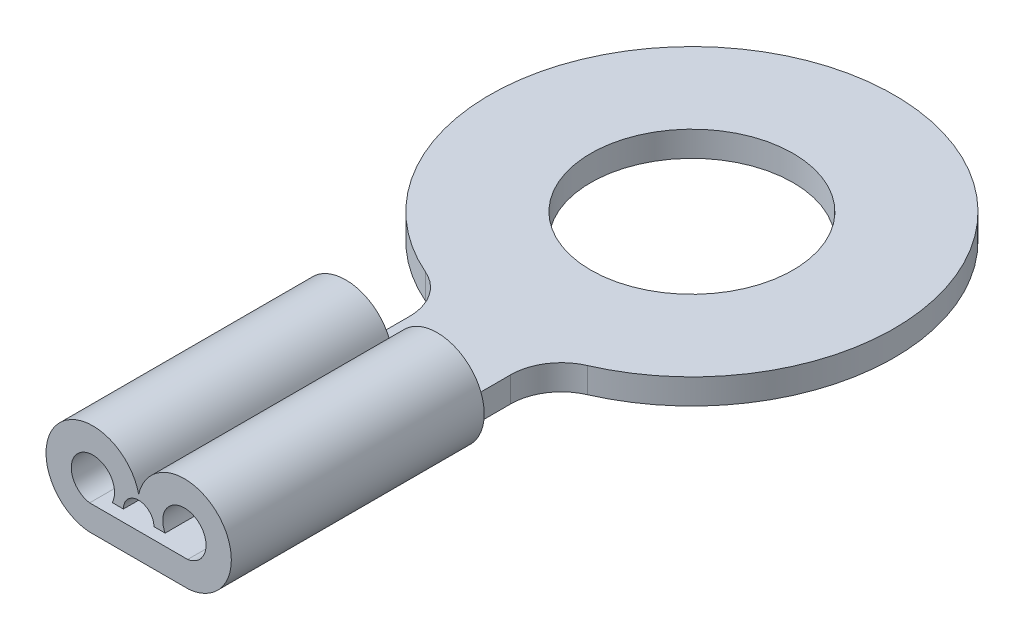
ISO-10303-21;
HEADER;
FILE_DESCRIPTION(('STEP AP214'),'2;1');
FILE_NAME('part.step','',(''),(''),'','','');
FILE_SCHEMA(('AUTOMOTIVE_DESIGN { 1 0 10303 214 1 1 1 1 }'));
ENDSEC;
DATA;
#1=APPLICATION_CONTEXT('core data for automotive mechanical design processes');
#2=APPLICATION_PROTOCOL_DEFINITION('international standard','automotive_design',2000,#1);
#3=PRODUCT_CONTEXT('',#1,'mechanical');
#4=PRODUCT('Part','Part','',(#3));
#5=PRODUCT_RELATED_PRODUCT_CATEGORY('part','',(#4));
#6=PRODUCT_DEFINITION_FORMATION('','',#4);
#7=PRODUCT_DEFINITION_CONTEXT('part definition',#1,'design');
#8=PRODUCT_DEFINITION('design','',#6,#7);
#9=PRODUCT_DEFINITION_SHAPE('','',#8);
#10=(LENGTH_UNIT() NAMED_UNIT(*) SI_UNIT(.MILLI.,.METRE.));
#11=(NAMED_UNIT(*) PLANE_ANGLE_UNIT() SI_UNIT($,.RADIAN.));
#12=(NAMED_UNIT(*) SI_UNIT($,.STERADIAN.) SOLID_ANGLE_UNIT());
#13=UNCERTAINTY_MEASURE_WITH_UNIT(LENGTH_MEASURE(1.E-05),#10,'distance_accuracy_value','');
#14=(GEOMETRIC_REPRESENTATION_CONTEXT(3) GLOBAL_UNCERTAINTY_ASSIGNED_CONTEXT((#13)) GLOBAL_UNIT_ASSIGNED_CONTEXT((#10,
#11,#12)) REPRESENTATION_CONTEXT('',''));
#15=CARTESIAN_POINT('',(0.,0.,0.));
#16=DIRECTION('',(0.,0.,1.));
#17=DIRECTION('',(1.,0.,0.));
#18=AXIS2_PLACEMENT_3D('',#15,#16,#17);
#19=CARTESIAN_POINT('',(-2.,0.5,4.58257569495584));
#20=DIRECTION('',(0.,-1.,0.));
#21=DIRECTION('',(0.,0.,-1.));
#22=AXIS2_PLACEMENT_3D('',#19,#20,#21);
#23=PLANE('',#22);
#24=DIRECTION('',(0.,0.,1.));
#25=VECTOR('',#24,1.);
#26=CARTESIAN_POINT('',(-1.,0.5,4.58257569495584));
#27=LINE('',#26,#25);
#28=CARTESIAN_POINT('',(-1.,0.5,4.58257569495584));
#29=VERTEX_POINT('',#28);
#30=CARTESIAN_POINT('',(-1.,0.5,5.93878443953007));
#31=VERTEX_POINT('',#30);
#32=EDGE_CURVE('E212',#29,#31,#27,.T.);
#33=ORIENTED_EDGE('',*,*,#32,.T.);
#34=DIRECTION('',(1.,0.,0.));
#35=VECTOR('',#34,1.);
#36=CARTESIAN_POINT('',(-2.,0.5,5.93878443953007));
#37=LINE('',#36,#35);
#38=CARTESIAN_POINT('',(-0.969184807981121,0.5,5.93878443953007));
#39=VERTEX_POINT('',#38);
#40=EDGE_CURVE('E196',#31,#39,#37,.T.);
#41=ORIENTED_EDGE('',*,*,#40,.T.);
#42=DIRECTION('',(0.,0.,1.));
#43=VECTOR('',#42,1.);
#44=CARTESIAN_POINT('',(-0.969184807981121,0.5,5.93878443953007));
#45=LINE('',#44,#43);
#46=CARTESIAN_POINT('',(-0.969184807981121,0.5,10.9387844395301));
#47=VERTEX_POINT('',#46);
#48=EDGE_CURVE('E200',#47,#39,#45,.F.);
#49=ORIENTED_EDGE('',*,*,#48,.F.);
#50=DIRECTION('',(1.,0.,0.));
#51=VECTOR('',#50,1.);
#52=CARTESIAN_POINT('',(-1.,0.5,10.9387844395301));
#53=LINE('',#52,#51);
#54=CARTESIAN_POINT('',(0.969184807981121,0.5,10.9387844395301));
#55=VERTEX_POINT('',#54);
#56=EDGE_CURVE('E52',#47,#55,#53,.T.);
#57=ORIENTED_EDGE('',*,*,#56,.T.);
#58=DIRECTION('',(0.,0.,1.));
#59=VECTOR('',#58,1.);
#60=CARTESIAN_POINT('',(0.969184807981121,0.5,5.93878443953007));
#61=LINE('',#60,#59);
#62=CARTESIAN_POINT('',(0.969184807981121,0.5,5.93878443953007));
#63=VERTEX_POINT('',#62);
#64=EDGE_CURVE('E47',#63,#55,#61,.T.);
#65=ORIENTED_EDGE('',*,*,#64,.F.);
#66=CARTESIAN_POINT('',(1.,0.5,5.93878443953007));
#67=VERTEX_POINT('',#66);
#68=EDGE_CURVE('E138',#63,#67,#37,.T.);
#69=ORIENTED_EDGE('',*,*,#68,.T.);
#70=DIRECTION('',(0.,0.,-1.));
#71=VECTOR('',#70,1.);
#72=CARTESIAN_POINT('',(1.,0.5,4.58257569495584));
#73=LINE('',#72,#71);
#74=CARTESIAN_POINT('',(1.,0.5,4.58257569495584));
#75=VERTEX_POINT('',#74);
#76=EDGE_CURVE('E217',#67,#75,#73,.T.);
#77=ORIENTED_EDGE('',*,*,#76,.T.);
#78=CARTESIAN_POINT('',(2.,0.5,4.58257569495584));
#79=DIRECTION('',(0.,-1.,0.));
#80=DIRECTION('',(0.,0.,1.));
#81=AXIS2_PLACEMENT_3D('',#78,#79,#80);
#82=CIRCLE('',#81,1.);
#83=CARTESIAN_POINT('',(1.6,0.5,3.66606055596467));
#84=VERTEX_POINT('',#83);
#85=EDGE_CURVE('E219',#75,#84,#82,.T.);
#86=ORIENTED_EDGE('',*,*,#85,.T.);
#87=CARTESIAN_POINT('',(0.,0.5,0.));
#88=DIRECTION('',(0.,1.,0.));
#89=DIRECTION('',(0.,0.,1.));
#90=AXIS2_PLACEMENT_3D('',#87,#88,#89);
#91=CIRCLE('',#90,4.);
#92=CARTESIAN_POINT('',(-1.6,0.5,3.66606055596467));
#93=VERTEX_POINT('',#92);
#94=EDGE_CURVE('E221',#84,#93,#91,.T.);
#95=ORIENTED_EDGE('',*,*,#94,.T.);
#96=CARTESIAN_POINT('',(-2.,0.5,4.58257569495584));
#97=DIRECTION('',(0.,-1.,0.));
#98=DIRECTION('',(0.,0.,-1.));
#99=AXIS2_PLACEMENT_3D('',#96,#97,#98);
#100=CIRCLE('',#99,1.);
#101=EDGE_CURVE('E209',#93,#29,#100,.T.);
#102=ORIENTED_EDGE('',*,*,#101,.T.);
#103=EDGE_LOOP('',(#33,#41,#49,#57,#65,#69,#77,#86,#95,#102));
#104=FACE_BOUND('',#103,.T.);
#105=CARTESIAN_POINT('',(0.,0.5,0.));
#106=DIRECTION('',(0.,1.,0.));
#107=DIRECTION('',(0.,0.,1.));
#108=AXIS2_PLACEMENT_3D('',#105,#106,#107);
#109=CIRCLE('',#108,2.);
#110=CARTESIAN_POINT('',(0.,0.5,2.));
#111=VERTEX_POINT('',#110);
#112=EDGE_CURVE('E203',#111,#111,#109,.T.);
#113=ORIENTED_EDGE('',*,*,#112,.F.);
#114=EDGE_LOOP('',(#113));
#115=FACE_BOUND('',#114,.T.);
#116=ADVANCED_FACE('F32',(#104,#115),#23,.F.);
#117=CARTESIAN_POINT('',(-2.,0.,4.58257569495584));
#118=DIRECTION('',(0.,-1.,0.));
#119=DIRECTION('',(0.,0.,-1.));
#120=AXIS2_PLACEMENT_3D('',#117,#118,#119);
#121=PLANE('',#120);
#122=DIRECTION('',(0.,0.,-1.));
#123=VECTOR('',#122,1.);
#124=CARTESIAN_POINT('',(1.,0.,4.58257569495584));
#125=LINE('',#124,#123);
#126=CARTESIAN_POINT('',(1.,0.,5.93878443953007));
#127=VERTEX_POINT('',#126);
#128=CARTESIAN_POINT('',(1.,0.,4.58257569495584));
#129=VERTEX_POINT('',#128);
#130=EDGE_CURVE('E232',#127,#129,#125,.T.);
#131=ORIENTED_EDGE('',*,*,#130,.F.);
#132=CARTESIAN_POINT('',(1.,0.,10.9387844395301));
#133=VERTEX_POINT('',#132);
#134=EDGE_CURVE('E233',#133,#127,#125,.T.);
#135=ORIENTED_EDGE('',*,*,#134,.F.);
#136=DIRECTION('',(1.,0.,0.));
#137=VECTOR('',#136,1.);
#138=CARTESIAN_POINT('',(-1.,0.,10.9387844395301));
#139=LINE('',#138,#137);
#140=CARTESIAN_POINT('',(-1.,0.,10.9387844395301));
#141=VERTEX_POINT('',#140);
#142=EDGE_CURVE('E229',#141,#133,#139,.T.);
#143=ORIENTED_EDGE('',*,*,#142,.F.);
#144=DIRECTION('',(0.,0.,1.));
#145=VECTOR('',#144,1.);
#146=CARTESIAN_POINT('',(-1.,0.,5.93878443953007));
#147=LINE('',#146,#145);
#148=CARTESIAN_POINT('',(-1.,0.,5.93878443953007));
#149=VERTEX_POINT('',#148);
#150=EDGE_CURVE('E186',#149,#141,#147,.T.);
#151=ORIENTED_EDGE('',*,*,#150,.F.);
#152=DIRECTION('',(0.,0.,1.));
#153=VECTOR('',#152,1.);
#154=CARTESIAN_POINT('',(-1.,0.,4.58257569495584));
#155=LINE('',#154,#153);
#156=CARTESIAN_POINT('',(-1.,0.,4.58257569495584));
#157=VERTEX_POINT('',#156);
#158=EDGE_CURVE('E226',#157,#149,#155,.T.);
#159=ORIENTED_EDGE('',*,*,#158,.F.);
#160=CARTESIAN_POINT('',(-2.,0.,4.58257569495584));
#161=DIRECTION('',(0.,-1.,0.));
#162=DIRECTION('',(0.,0.,-1.));
#163=AXIS2_PLACEMENT_3D('',#160,#161,#162);
#164=CIRCLE('',#163,1.);
#165=CARTESIAN_POINT('',(-1.6,0.,3.66606055596467));
#166=VERTEX_POINT('',#165);
#167=EDGE_CURVE('E206',#166,#157,#164,.T.);
#168=ORIENTED_EDGE('',*,*,#167,.F.);
#169=CARTESIAN_POINT('',(0.,0.,0.));
#170=DIRECTION('',(0.,1.,0.));
#171=DIRECTION('',(0.,0.,1.));
#172=AXIS2_PLACEMENT_3D('',#169,#170,#171);
#173=CIRCLE('',#172,4.);
#174=CARTESIAN_POINT('',(1.6,0.,3.66606055596467));
#175=VERTEX_POINT('',#174);
#176=EDGE_CURVE('E213',#175,#166,#173,.T.);
#177=ORIENTED_EDGE('',*,*,#176,.F.);
#178=CARTESIAN_POINT('',(2.,0.,4.58257569495584));
#179=DIRECTION('',(0.,-1.,0.));
#180=DIRECTION('',(0.,0.,1.));
#181=AXIS2_PLACEMENT_3D('',#178,#179,#180);
#182=CIRCLE('',#181,1.);
#183=EDGE_CURVE('E236',#129,#175,#182,.T.);
#184=ORIENTED_EDGE('',*,*,#183,.F.);
#185=EDGE_LOOP('',(#131,#135,#143,#151,#159,#168,#177,#184));
#186=FACE_BOUND('',#185,.T.);
#187=CARTESIAN_POINT('',(0.,0.,0.));
#188=DIRECTION('',(0.,1.,0.));
#189=DIRECTION('',(0.,0.,1.));
#190=AXIS2_PLACEMENT_3D('',#187,#188,#189);
#191=CIRCLE('',#190,2.);
#192=CARTESIAN_POINT('',(0.,0.,2.));
#193=VERTEX_POINT('',#192);
#194=EDGE_CURVE('E202',#193,#193,#191,.T.);
#195=ORIENTED_EDGE('',*,*,#194,.T.);
#196=EDGE_LOOP('',(#195));
#197=FACE_BOUND('',#196,.T.);
#198=ADVANCED_FACE('F257',(#186,#197),#121,.T.);
#199=CARTESIAN_POINT('',(-2.,0.5,4.58257569495584));
#200=DIRECTION('',(0.,-1.,0.));
#201=DIRECTION('',(0.,0.,-1.));
#202=AXIS2_PLACEMENT_3D('',#199,#200,#201);
#203=CYLINDRICAL_SURFACE('',#202,1.);
#204=ORIENTED_EDGE('',*,*,#167,.T.);
#205=DIRECTION('',(0.,-1.,0.));
#206=VECTOR('',#205,1.);
#207=CARTESIAN_POINT('',(-1.,0.5,4.58257569495584));
#208=LINE('',#207,#206);
#209=EDGE_CURVE('E40',#29,#157,#208,.T.);
#210=ORIENTED_EDGE('',*,*,#209,.F.);
#211=ORIENTED_EDGE('',*,*,#101,.F.);
#212=DIRECTION('',(0.,-1.,0.));
#213=VECTOR('',#212,1.);
#214=CARTESIAN_POINT('',(-1.6,0.5,3.66606055596467));
#215=LINE('',#214,#213);
#216=EDGE_CURVE('E223',#93,#166,#215,.T.);
#217=ORIENTED_EDGE('',*,*,#216,.T.);
#218=EDGE_LOOP('',(#204,#210,#211,#217));
#219=FACE_BOUND('',#218,.T.);
#220=ADVANCED_FACE('F34',(#219),#203,.F.);
#221=CARTESIAN_POINT('',(-1.,0.5,4.58257569495584));
#222=DIRECTION('',(1.,0.,0.));
#223=DIRECTION('',(0.,0.,-1.));
#224=AXIS2_PLACEMENT_3D('',#221,#222,#223);
#225=PLANE('',#224);
#226=ORIENTED_EDGE('',*,*,#158,.T.);
#227=DIRECTION('',(0.,1.,0.));
#228=VECTOR('',#227,1.);
#229=CARTESIAN_POINT('',(-1.,0.5,5.93878443953007));
#230=LINE('',#229,#228);
#231=EDGE_CURVE('E195',#149,#31,#230,.T.);
#232=ORIENTED_EDGE('',*,*,#231,.T.);
#233=ORIENTED_EDGE('',*,*,#32,.F.);
#234=ORIENTED_EDGE('',*,*,#209,.T.);
#235=EDGE_LOOP('',(#226,#232,#233,#234));
#236=FACE_BOUND('',#235,.T.);
#237=ADVANCED_FACE('F249',(#236),#225,.F.);
#238=CARTESIAN_POINT('',(-1.,0.5,10.9387844395301));
#239=DIRECTION('',(0.,0.,-1.));
#240=DIRECTION('',(-1.,0.,0.));
#241=AXIS2_PLACEMENT_3D('',#238,#239,#240);
#242=PLANE('',#241);
#243=ORIENTED_EDGE('',*,*,#56,.F.);
#244=CARTESIAN_POINT('',(-0.90429780550037,0.922932306539,10.9387844395301));
#245=DIRECTION('',(0.,0.,1.));
#246=DIRECTION('',(-1.,0.,0.));
#247=AXIS2_PLACEMENT_3D('',#244,#245,#246);
#248=CIRCLE('',#247,0.427880893480108);
#249=CARTESIAN_POINT('',(-0.5234496202361,0.727902260683885,10.9387844395301));
#250=VERTEX_POINT('',#249);
#251=EDGE_CURVE('E162',#250,#47,#248,.T.);
#252=ORIENTED_EDGE('',*,*,#251,.F.);
#253=DIRECTION('',(-1.,0.,0.));
#254=VECTOR('',#253,1.);
#255=CARTESIAN_POINT('',(-0.5234496202361,0.727902260683885,10.9387844395301));
#256=LINE('',#255,#254);
#257=CARTESIAN_POINT('',(-0.302000478442595,0.727902260683885,10.9387844395301));
#258=VERTEX_POINT('',#257);
#259=EDGE_CURVE('E170',#258,#250,#256,.T.);
#260=ORIENTED_EDGE('',*,*,#259,.F.);
#261=CARTESIAN_POINT('',(0.,0.727902260683885,10.9387844395301));
#262=DIRECTION('',(0.,0.,1.));
#263=DIRECTION('',(1.,0.,0.));
#264=AXIS2_PLACEMENT_3D('',#261,#262,#263);
#265=CIRCLE('',#264,0.302000478442594);
#266=CARTESIAN_POINT('',(0.302000478442594,0.727902260683885,10.9387844395301));
#267=VERTEX_POINT('',#266);
#268=EDGE_CURVE('E167',#267,#258,#265,.T.);
#269=ORIENTED_EDGE('',*,*,#268,.F.);
#270=DIRECTION('',(-1.,0.,0.));
#271=VECTOR('',#270,1.);
#272=CARTESIAN_POINT('',(0.302000478442594,0.727902260683885,10.9387844395301));
#273=LINE('',#272,#271);
#274=CARTESIAN_POINT('',(0.5234496202361,0.727902260683886,10.9387844395301));
#275=VERTEX_POINT('',#274);
#276=EDGE_CURVE('E165',#275,#267,#273,.T.);
#277=ORIENTED_EDGE('',*,*,#276,.F.);
#278=CARTESIAN_POINT('',(0.90429780550037,0.922932306539,10.9387844395301));
#279=DIRECTION('',(0.,0.,1.));
#280=DIRECTION('',(1.,0.,0.));
#281=AXIS2_PLACEMENT_3D('',#278,#279,#280);
#282=CIRCLE('',#281,0.427880893480108);
#283=EDGE_CURVE('E146',#55,#275,#282,.T.);
#284=ORIENTED_EDGE('',*,*,#283,.F.);
#285=EDGE_LOOP('',(#243,#252,#260,#269,#277,#284));
#286=FACE_BOUND('',#285,.T.);
#287=CARTESIAN_POINT('',(-0.90429780550037,0.922932306539,10.9387844395301));
#288=DIRECTION('',(0.,0.,1.));
#289=DIRECTION('',(-1.,0.,0.));
#290=AXIS2_PLACEMENT_3D('',#287,#288,#289);
#291=CIRCLE('',#290,0.927880893480108);
#292=CARTESIAN_POINT('',(0.,1.13079868538046,10.9387844395301));
#293=VERTEX_POINT('',#292);
#294=EDGE_CURVE('E175',#293,#141,#291,.T.);
#295=ORIENTED_EDGE('',*,*,#294,.T.);
#296=ORIENTED_EDGE('',*,*,#142,.T.);
#297=CARTESIAN_POINT('',(0.90429780550037,0.922932306539,10.9387844395301));
#298=DIRECTION('',(0.,0.,1.));
#299=DIRECTION('',(1.,0.,0.));
#300=AXIS2_PLACEMENT_3D('',#297,#298,#299);
#301=CIRCLE('',#300,0.927880893480108);
#302=EDGE_CURVE('E183',#133,#293,#301,.T.);
#303=ORIENTED_EDGE('',*,*,#302,.T.);
#304=EDGE_LOOP('',(#295,#296,#303));
#305=FACE_BOUND('',#304,.T.);
#306=ADVANCED_FACE('F271',(#286,#305),#242,.F.);
#307=CARTESIAN_POINT('',(1.,0.5,4.58257569495584));
#308=DIRECTION('',(-1.,0.,0.));
#309=DIRECTION('',(0.,0.,1.));
#310=AXIS2_PLACEMENT_3D('',#307,#308,#309);
#311=PLANE('',#310);
#312=ORIENTED_EDGE('',*,*,#76,.F.);
#313=DIRECTION('',(0.,-1.,0.));
#314=VECTOR('',#313,1.);
#315=CARTESIAN_POINT('',(1.,0.5,5.93878443953007));
#316=LINE('',#315,#314);
#317=EDGE_CURVE('E11',#67,#127,#316,.T.);
#318=ORIENTED_EDGE('',*,*,#317,.T.);
#319=ORIENTED_EDGE('',*,*,#130,.T.);
#320=DIRECTION('',(0.,-1.,0.));
#321=VECTOR('',#320,1.);
#322=CARTESIAN_POINT('',(1.,0.5,4.58257569495584));
#323=LINE('',#322,#321);
#324=EDGE_CURVE('E244',#75,#129,#323,.T.);
#325=ORIENTED_EDGE('',*,*,#324,.F.);
#326=EDGE_LOOP('',(#312,#318,#319,#325));
#327=FACE_BOUND('',#326,.T.);
#328=ADVANCED_FACE('F273',(#327),#311,.F.);
#329=CARTESIAN_POINT('',(2.,0.5,4.58257569495584));
#330=DIRECTION('',(0.,-1.,0.));
#331=DIRECTION('',(0.,0.,-1.));
#332=AXIS2_PLACEMENT_3D('',#329,#330,#331);
#333=CYLINDRICAL_SURFACE('',#332,1.);
#334=ORIENTED_EDGE('',*,*,#183,.T.);
#335=DIRECTION('',(0.,-1.,0.));
#336=VECTOR('',#335,1.);
#337=CARTESIAN_POINT('',(1.6,0.5,3.66606055596467));
#338=LINE('',#337,#336);
#339=EDGE_CURVE('E241',#84,#175,#338,.T.);
#340=ORIENTED_EDGE('',*,*,#339,.F.);
#341=ORIENTED_EDGE('',*,*,#85,.F.);
#342=ORIENTED_EDGE('',*,*,#324,.T.);
#343=EDGE_LOOP('',(#334,#340,#341,#342));
#344=FACE_BOUND('',#343,.T.);
#345=ADVANCED_FACE('F280',(#344),#333,.F.);
#346=CARTESIAN_POINT('',(0.,0.5,0.));
#347=DIRECTION('',(0.,-1.,0.));
#348=DIRECTION('',(0.,0.,-1.));
#349=AXIS2_PLACEMENT_3D('',#346,#347,#348);
#350=CYLINDRICAL_SURFACE('',#349,4.);
#351=ORIENTED_EDGE('',*,*,#176,.T.);
#352=ORIENTED_EDGE('',*,*,#216,.F.);
#353=ORIENTED_EDGE('',*,*,#94,.F.);
#354=ORIENTED_EDGE('',*,*,#339,.T.);
#355=EDGE_LOOP('',(#351,#352,#353,#354));
#356=FACE_BOUND('',#355,.T.);
#357=ADVANCED_FACE('F294',(#356),#350,.T.);
#358=CARTESIAN_POINT('',(0.,0.5,0.));
#359=DIRECTION('',(0.,-1.,0.));
#360=DIRECTION('',(0.,0.,-1.));
#361=AXIS2_PLACEMENT_3D('',#358,#359,#360);
#362=CYLINDRICAL_SURFACE('',#361,2.);
#363=ORIENTED_EDGE('',*,*,#112,.T.);
#364=EDGE_LOOP('',(#363));
#365=FACE_BOUND('',#364,.T.);
#366=ORIENTED_EDGE('',*,*,#194,.F.);
#367=EDGE_LOOP('',(#366));
#368=FACE_BOUND('',#367,.T.);
#369=ADVANCED_FACE('F291',(#365,#368),#362,.F.);
#370=CARTESIAN_POINT('',(-0.90429780550037,0.922932306539,5.93878443953007));
#371=DIRECTION('',(0.,0.,1.));
#372=DIRECTION('',(1.,0.,0.));
#373=AXIS2_PLACEMENT_3D('',#370,#371,#372);
#374=CYLINDRICAL_SURFACE('',#373,0.427880893480108);
#375=ORIENTED_EDGE('',*,*,#251,.T.);
#376=ORIENTED_EDGE('',*,*,#48,.T.);
#377=CARTESIAN_POINT('',(-0.90429780550037,0.922932306539,5.93878443953007));
#378=DIRECTION('',(0.,0.,1.));
#379=DIRECTION('',(-1.,0.,0.));
#380=AXIS2_PLACEMENT_3D('',#377,#378,#379);
#381=CIRCLE('',#380,0.427880893480108);
#382=CARTESIAN_POINT('',(-0.5234496202361,0.727902260683885,5.93878443953007));
#383=VERTEX_POINT('',#382);
#384=EDGE_CURVE('E140',#383,#39,#381,.T.);
#385=ORIENTED_EDGE('',*,*,#384,.F.);
#386=DIRECTION('',(0.,0.,1.));
#387=VECTOR('',#386,1.);
#388=CARTESIAN_POINT('',(-0.5234496202361,0.727902260683885,5.93878443953007));
#389=LINE('',#388,#387);
#390=EDGE_CURVE('E173',#383,#250,#389,.T.);
#391=ORIENTED_EDGE('',*,*,#390,.T.);
#392=EDGE_LOOP('',(#375,#376,#385,#391));
#393=FACE_BOUND('',#392,.T.);
#394=ADVANCED_FACE('F312',(#393),#374,.F.);
#395=CARTESIAN_POINT('',(0.90429780550037,0.922932306539,5.93878443953007));
#396=DIRECTION('',(0.,0.,1.));
#397=DIRECTION('',(1.,0.,0.));
#398=AXIS2_PLACEMENT_3D('',#395,#396,#397);
#399=CYLINDRICAL_SURFACE('',#398,0.427880893480108);
#400=CARTESIAN_POINT('',(0.90429780550037,0.922932306539,5.93878443953007));
#401=DIRECTION('',(0.,0.,1.));
#402=DIRECTION('',(1.,0.,0.));
#403=AXIS2_PLACEMENT_3D('',#400,#401,#402);
#404=CIRCLE('',#403,0.427880893480108);
#405=CARTESIAN_POINT('',(0.5234496202361,0.727902260683886,5.93878443953007));
#406=VERTEX_POINT('',#405);
#407=EDGE_CURVE('E131',#63,#406,#404,.T.);
#408=ORIENTED_EDGE('',*,*,#407,.F.);
#409=ORIENTED_EDGE('',*,*,#64,.T.);
#410=ORIENTED_EDGE('',*,*,#283,.T.);
#411=DIRECTION('',(0.,0.,1.));
#412=VECTOR('',#411,1.);
#413=CARTESIAN_POINT('',(0.5234496202361,0.727902260683886,5.93878443953007));
#414=LINE('',#413,#412);
#415=EDGE_CURVE('E143',#406,#275,#414,.T.);
#416=ORIENTED_EDGE('',*,*,#415,.F.);
#417=EDGE_LOOP('',(#408,#409,#410,#416));
#418=FACE_BOUND('',#417,.T.);
#419=ADVANCED_FACE('F144',(#418),#399,.F.);
#420=CARTESIAN_POINT('',(-0.90429780550037,0.922932306539,5.93878443953007));
#421=DIRECTION('',(0.,0.,-1.));
#422=DIRECTION('',(-1.,0.,0.));
#423=AXIS2_PLACEMENT_3D('',#420,#421,#422);
#424=PLANE('',#423);
#425=ORIENTED_EDGE('',*,*,#40,.F.);
#426=ORIENTED_EDGE('',*,*,#231,.F.);
#427=CARTESIAN_POINT('',(-0.90429780550037,0.922932306539,5.93878443953007));
#428=DIRECTION('',(0.,0.,1.));
#429=DIRECTION('',(-1.,0.,0.));
#430=AXIS2_PLACEMENT_3D('',#427,#428,#429);
#431=CIRCLE('',#430,0.927880893480108);
#432=CARTESIAN_POINT('',(0.,1.13079868538046,5.93878443953007));
#433=VERTEX_POINT('',#432);
#434=EDGE_CURVE('E179',#433,#149,#431,.T.);
#435=ORIENTED_EDGE('',*,*,#434,.F.);
#436=CARTESIAN_POINT('',(0.90429780550037,0.922932306539,5.93878443953007));
#437=DIRECTION('',(0.,0.,1.));
#438=DIRECTION('',(1.,0.,0.));
#439=AXIS2_PLACEMENT_3D('',#436,#437,#438);
#440=CIRCLE('',#439,0.927880893480108);
#441=EDGE_CURVE('E182',#127,#433,#440,.T.);
#442=ORIENTED_EDGE('',*,*,#441,.F.);
#443=ORIENTED_EDGE('',*,*,#317,.F.);
#444=ORIENTED_EDGE('',*,*,#68,.F.);
#445=ORIENTED_EDGE('',*,*,#407,.T.);
#446=DIRECTION('',(-1.,0.,0.));
#447=VECTOR('',#446,1.);
#448=CARTESIAN_POINT('',(0.302000478442594,0.727902260683885,5.93878443953007));
#449=LINE('',#448,#447);
#450=CARTESIAN_POINT('',(0.302000478442594,0.727902260683885,5.93878443953007));
#451=VERTEX_POINT('',#450);
#452=EDGE_CURVE('E136',#406,#451,#449,.T.);
#453=ORIENTED_EDGE('',*,*,#452,.T.);
#454=CARTESIAN_POINT('',(0.,0.727902260683885,5.93878443953007));
#455=DIRECTION('',(0.,0.,1.));
#456=DIRECTION('',(1.,0.,0.));
#457=AXIS2_PLACEMENT_3D('',#454,#455,#456);
#458=CIRCLE('',#457,0.302000478442594);
#459=CARTESIAN_POINT('',(-0.302000478442595,0.727902260683885,5.93878443953007));
#460=VERTEX_POINT('',#459);
#461=EDGE_CURVE('E155',#451,#460,#458,.T.);
#462=ORIENTED_EDGE('',*,*,#461,.T.);
#463=DIRECTION('',(-1.,0.,0.));
#464=VECTOR('',#463,1.);
#465=CARTESIAN_POINT('',(-0.5234496202361,0.727902260683885,5.93878443953007));
#466=LINE('',#465,#464);
#467=EDGE_CURVE('E151',#460,#383,#466,.T.);
#468=ORIENTED_EDGE('',*,*,#467,.T.);
#469=ORIENTED_EDGE('',*,*,#384,.T.);
#470=EDGE_LOOP('',(#425,#426,#435,#442,#443,#444,#445,#453,#462,#468,#469));
#471=FACE_BOUND('',#470,.T.);
#472=ADVANCED_FACE('F133',(#471),#424,.T.);
#473=CARTESIAN_POINT('',(-0.90429780550037,0.922932306539,5.93878443953007));
#474=DIRECTION('',(0.,0.,1.));
#475=DIRECTION('',(1.,0.,0.));
#476=AXIS2_PLACEMENT_3D('',#473,#474,#475);
#477=CYLINDRICAL_SURFACE('',#476,0.927880893480108);
#478=ORIENTED_EDGE('',*,*,#294,.F.);
#479=DIRECTION('',(0.,0.,1.));
#480=VECTOR('',#479,1.);
#481=CARTESIAN_POINT('',(0.,1.13079868538046,5.93878443953007));
#482=LINE('',#481,#480);
#483=EDGE_CURVE('E190',#433,#293,#482,.T.);
#484=ORIENTED_EDGE('',*,*,#483,.F.);
#485=ORIENTED_EDGE('',*,*,#434,.T.);
#486=ORIENTED_EDGE('',*,*,#150,.T.);
#487=EDGE_LOOP('',(#478,#484,#485,#486));
#488=FACE_BOUND('',#487,.T.);
#489=ADVANCED_FACE('F264',(#488),#477,.T.);
#490=CARTESIAN_POINT('',(0.90429780550037,0.922932306539,5.93878443953007));
#491=DIRECTION('',(0.,0.,1.));
#492=DIRECTION('',(1.,0.,0.));
#493=AXIS2_PLACEMENT_3D('',#490,#491,#492);
#494=CYLINDRICAL_SURFACE('',#493,0.927880893480108);
#495=ORIENTED_EDGE('',*,*,#302,.F.);
#496=ORIENTED_EDGE('',*,*,#134,.T.);
#497=ORIENTED_EDGE('',*,*,#441,.T.);
#498=ORIENTED_EDGE('',*,*,#483,.T.);
#499=EDGE_LOOP('',(#495,#496,#497,#498));
#500=FACE_BOUND('',#499,.T.);
#501=ADVANCED_FACE('F269',(#500),#494,.T.);
#502=CARTESIAN_POINT('',(-0.5234496202361,0.727902260683885,5.93878443953007));
#503=DIRECTION('',(0.,1.,0.));
#504=DIRECTION('',(0.,0.,1.));
#505=AXIS2_PLACEMENT_3D('',#502,#503,#504);
#506=PLANE('',#505);
#507=ORIENTED_EDGE('',*,*,#259,.T.);
#508=ORIENTED_EDGE('',*,*,#390,.F.);
#509=ORIENTED_EDGE('',*,*,#467,.F.);
#510=DIRECTION('',(0.,0.,1.));
#511=VECTOR('',#510,1.);
#512=CARTESIAN_POINT('',(-0.302000478442595,0.727902260683885,5.93878443953007));
#513=LINE('',#512,#511);
#514=EDGE_CURVE('E176',#460,#258,#513,.T.);
#515=ORIENTED_EDGE('',*,*,#514,.T.);
#516=EDGE_LOOP('',(#507,#508,#509,#515));
#517=FACE_BOUND('',#516,.T.);
#518=ADVANCED_FACE('F319',(#517),#506,.F.);
#519=CARTESIAN_POINT('',(0.,0.727902260683885,5.93878443953007));
#520=DIRECTION('',(0.,0.,1.));
#521=DIRECTION('',(1.,0.,0.));
#522=AXIS2_PLACEMENT_3D('',#519,#520,#521);
#523=CYLINDRICAL_SURFACE('',#522,0.302000478442594);
#524=ORIENTED_EDGE('',*,*,#268,.T.);
#525=ORIENTED_EDGE('',*,*,#514,.F.);
#526=ORIENTED_EDGE('',*,*,#461,.F.);
#527=DIRECTION('',(0.,0.,1.));
#528=VECTOR('',#527,1.);
#529=CARTESIAN_POINT('',(0.302000478442594,0.727902260683885,5.93878443953007));
#530=LINE('',#529,#528);
#531=EDGE_CURVE('E150',#451,#267,#530,.T.);
#532=ORIENTED_EDGE('',*,*,#531,.T.);
#533=EDGE_LOOP('',(#524,#525,#526,#532));
#534=FACE_BOUND('',#533,.T.);
#535=ADVANCED_FACE('F317',(#534),#523,.F.);
#536=CARTESIAN_POINT('',(0.302000478442594,0.727902260683885,5.93878443953007));
#537=DIRECTION('',(0.,1.,0.));
#538=DIRECTION('',(0.,0.,1.));
#539=AXIS2_PLACEMENT_3D('',#536,#537,#538);
#540=PLANE('',#539);
#541=ORIENTED_EDGE('',*,*,#276,.T.);
#542=ORIENTED_EDGE('',*,*,#531,.F.);
#543=ORIENTED_EDGE('',*,*,#452,.F.);
#544=ORIENTED_EDGE('',*,*,#415,.T.);
#545=EDGE_LOOP('',(#541,#542,#543,#544));
#546=FACE_BOUND('',#545,.T.);
#547=ADVANCED_FACE('F153',(#546),#540,.F.);
#548=CLOSED_SHELL('',(#116,#198,#220,#237,#306,#328,#345,#357,#369,#394,#419,#472,#489,#501,
#518,#535,#547));
#549=MANIFOLD_SOLID_BREP('B2',#548);
#550=ADVANCED_BREP_SHAPE_REPRESENTATION('',(#18,#549),#14);
#551=SHAPE_DEFINITION_REPRESENTATION(#9,#550);
ENDSEC;
END-ISO-10303-21;
